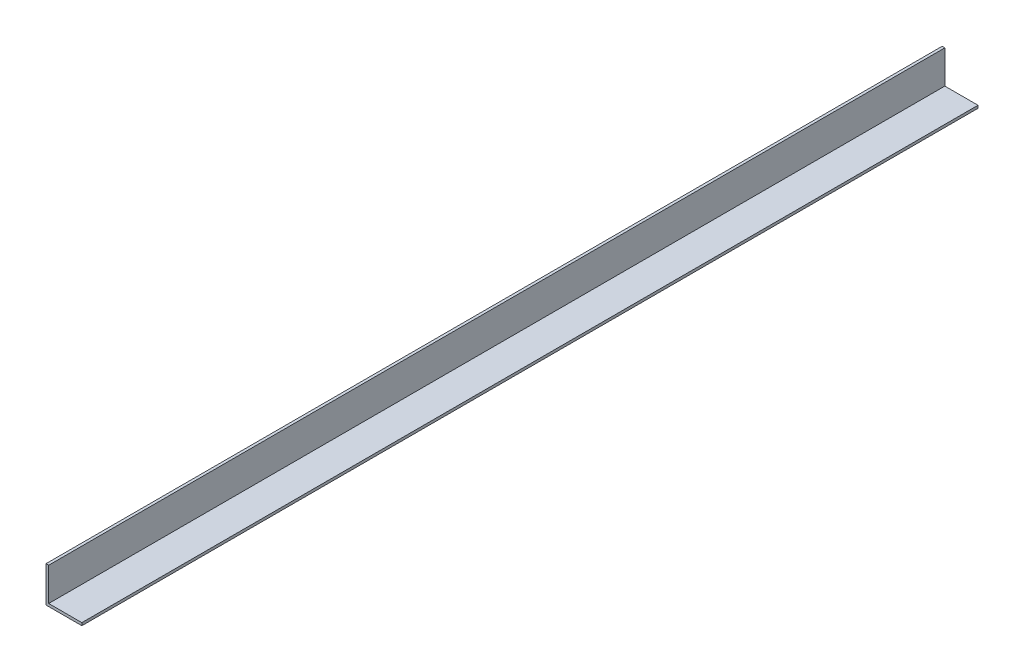
ISO-10303-21;
HEADER;
FILE_DESCRIPTION(('STEP AP214'),'2;1');
FILE_NAME('part.step','',(''),(''),'','','');
FILE_SCHEMA(('AUTOMOTIVE_DESIGN { 1 0 10303 214 1 1 1 1 }'));
ENDSEC;
DATA;
#1=APPLICATION_CONTEXT('core data for automotive mechanical design processes');
#2=APPLICATION_PROTOCOL_DEFINITION('international standard','automotive_design',2000,#1);
#3=PRODUCT_CONTEXT('',#1,'mechanical');
#4=PRODUCT('Part','Part','',(#3));
#5=PRODUCT_RELATED_PRODUCT_CATEGORY('part','',(#4));
#6=PRODUCT_DEFINITION_FORMATION('','',#4);
#7=PRODUCT_DEFINITION_CONTEXT('part definition',#1,'design');
#8=PRODUCT_DEFINITION('design','',#6,#7);
#9=PRODUCT_DEFINITION_SHAPE('','',#8);
#10=(LENGTH_UNIT() NAMED_UNIT(*) SI_UNIT(.MILLI.,.METRE.));
#11=(NAMED_UNIT(*) PLANE_ANGLE_UNIT() SI_UNIT($,.RADIAN.));
#12=(NAMED_UNIT(*) SI_UNIT($,.STERADIAN.) SOLID_ANGLE_UNIT());
#13=UNCERTAINTY_MEASURE_WITH_UNIT(LENGTH_MEASURE(1.E-05),#10,'distance_accuracy_value','');
#14=(GEOMETRIC_REPRESENTATION_CONTEXT(3) GLOBAL_UNCERTAINTY_ASSIGNED_CONTEXT((#13)) GLOBAL_UNIT_ASSIGNED_CONTEXT((#10,
#11,#12)) REPRESENTATION_CONTEXT('',''));
#15=CARTESIAN_POINT('',(0.,0.,0.));
#16=DIRECTION('',(0.,0.,1.));
#17=DIRECTION('',(1.,0.,0.));
#18=AXIS2_PLACEMENT_3D('',#15,#16,#17);
#19=CARTESIAN_POINT('',(3.,40.,1000.));
#20=DIRECTION('',(0.,-1.,0.));
#21=DIRECTION('',(0.,0.,-1.));
#22=AXIS2_PLACEMENT_3D('',#19,#20,#21);
#23=PLANE('',#22);
#24=DIRECTION('',(-1.,0.,0.));
#25=VECTOR('',#24,1.);
#26=CARTESIAN_POINT('',(3.,40.,0.));
#27=LINE('',#26,#25);
#28=CARTESIAN_POINT('',(3.,40.,0.));
#29=VERTEX_POINT('',#28);
#30=CARTESIAN_POINT('',(0.,40.,0.));
#31=VERTEX_POINT('',#30);
#32=EDGE_CURVE('E118',#29,#31,#27,.T.);
#33=ORIENTED_EDGE('',*,*,#32,.T.);
#34=DIRECTION('',(0.,0.,-1.));
#35=VECTOR('',#34,1.);
#36=CARTESIAN_POINT('',(0.,40.,1000.));
#37=LINE('',#36,#35);
#38=CARTESIAN_POINT('',(0.,40.,1000.));
#39=VERTEX_POINT('',#38);
#40=EDGE_CURVE('E11',#39,#31,#37,.T.);
#41=ORIENTED_EDGE('',*,*,#40,.F.);
#42=DIRECTION('',(-1.,0.,0.));
#43=VECTOR('',#42,1.);
#44=CARTESIAN_POINT('',(3.,40.,1000.));
#45=LINE('',#44,#43);
#46=CARTESIAN_POINT('',(3.,40.,1000.));
#47=VERTEX_POINT('',#46);
#48=EDGE_CURVE('E128',#47,#39,#45,.T.);
#49=ORIENTED_EDGE('',*,*,#48,.F.);
#50=DIRECTION('',(0.,0.,-1.));
#51=VECTOR('',#50,1.);
#52=CARTESIAN_POINT('',(3.,40.,1000.));
#53=LINE('',#52,#51);
#54=EDGE_CURVE('E114',#47,#29,#53,.T.);
#55=ORIENTED_EDGE('',*,*,#54,.T.);
#56=EDGE_LOOP('',(#33,#41,#49,#55));
#57=FACE_BOUND('',#56,.T.);
#58=ADVANCED_FACE('F34',(#57),#23,.F.);
#59=CARTESIAN_POINT('',(0.,40.,1000.));
#60=DIRECTION('',(1.,0.,0.));
#61=DIRECTION('',(0.,1.,0.));
#62=AXIS2_PLACEMENT_3D('',#59,#60,#61);
#63=PLANE('',#62);
#64=DIRECTION('',(0.,-1.,0.));
#65=VECTOR('',#64,1.);
#66=CARTESIAN_POINT('',(0.,40.,0.));
#67=LINE('',#66,#65);
#68=CARTESIAN_POINT('',(0.,0.,0.));
#69=VERTEX_POINT('',#68);
#70=EDGE_CURVE('E121',#31,#69,#67,.T.);
#71=ORIENTED_EDGE('',*,*,#70,.T.);
#72=DIRECTION('',(0.,0.,-1.));
#73=VECTOR('',#72,1.);
#74=CARTESIAN_POINT('',(0.,0.,1000.));
#75=LINE('',#74,#73);
#76=CARTESIAN_POINT('',(0.,0.,1000.));
#77=VERTEX_POINT('',#76);
#78=EDGE_CURVE('E42',#77,#69,#75,.T.);
#79=ORIENTED_EDGE('',*,*,#78,.F.);
#80=DIRECTION('',(0.,-1.,0.));
#81=VECTOR('',#80,1.);
#82=CARTESIAN_POINT('',(0.,40.,1000.));
#83=LINE('',#82,#81);
#84=EDGE_CURVE('E87',#39,#77,#83,.T.);
#85=ORIENTED_EDGE('',*,*,#84,.F.);
#86=ORIENTED_EDGE('',*,*,#40,.T.);
#87=EDGE_LOOP('',(#71,#79,#85,#86));
#88=FACE_BOUND('',#87,.T.);
#89=ADVANCED_FACE('F152',(#88),#63,.F.);
#90=CARTESIAN_POINT('',(0.,0.,1000.));
#91=DIRECTION('',(0.,1.,0.));
#92=DIRECTION('',(0.,0.,1.));
#93=AXIS2_PLACEMENT_3D('',#90,#91,#92);
#94=PLANE('',#93);
#95=DIRECTION('',(1.,0.,0.));
#96=VECTOR('',#95,1.);
#97=CARTESIAN_POINT('',(0.,0.,0.));
#98=LINE('',#97,#96);
#99=CARTESIAN_POINT('',(40.,0.,0.));
#100=VERTEX_POINT('',#99);
#101=EDGE_CURVE('E123',#69,#100,#98,.T.);
#102=ORIENTED_EDGE('',*,*,#101,.T.);
#103=DIRECTION('',(0.,0.,-1.));
#104=VECTOR('',#103,1.);
#105=CARTESIAN_POINT('',(40.,0.,1000.));
#106=LINE('',#105,#104);
#107=CARTESIAN_POINT('',(40.,0.,1000.));
#108=VERTEX_POINT('',#107);
#109=EDGE_CURVE('E109',#108,#100,#106,.T.);
#110=ORIENTED_EDGE('',*,*,#109,.F.);
#111=DIRECTION('',(1.,0.,0.));
#112=VECTOR('',#111,1.);
#113=CARTESIAN_POINT('',(0.,0.,1000.));
#114=LINE('',#113,#112);
#115=EDGE_CURVE('E100',#77,#108,#114,.T.);
#116=ORIENTED_EDGE('',*,*,#115,.F.);
#117=ORIENTED_EDGE('',*,*,#78,.T.);
#118=EDGE_LOOP('',(#102,#110,#116,#117));
#119=FACE_BOUND('',#118,.T.);
#120=ADVANCED_FACE('F134',(#119),#94,.F.);
#121=CARTESIAN_POINT('',(40.,0.,1000.));
#122=DIRECTION('',(-1.,0.,0.));
#123=DIRECTION('',(0.,0.,1.));
#124=AXIS2_PLACEMENT_3D('',#121,#122,#123);
#125=PLANE('',#124);
#126=DIRECTION('',(0.,1.,0.));
#127=VECTOR('',#126,1.);
#128=CARTESIAN_POINT('',(40.,0.,0.));
#129=LINE('',#128,#127);
#130=CARTESIAN_POINT('',(40.,3.,0.));
#131=VERTEX_POINT('',#130);
#132=EDGE_CURVE('E108',#100,#131,#129,.T.);
#133=ORIENTED_EDGE('',*,*,#132,.T.);
#134=DIRECTION('',(0.,0.,-1.));
#135=VECTOR('',#134,1.);
#136=CARTESIAN_POINT('',(40.,3.,1000.));
#137=LINE('',#136,#135);
#138=CARTESIAN_POINT('',(40.,3.,1000.));
#139=VERTEX_POINT('',#138);
#140=EDGE_CURVE('E105',#139,#131,#137,.T.);
#141=ORIENTED_EDGE('',*,*,#140,.F.);
#142=DIRECTION('',(0.,1.,0.));
#143=VECTOR('',#142,1.);
#144=CARTESIAN_POINT('',(40.,0.,1000.));
#145=LINE('',#144,#143);
#146=EDGE_CURVE('E94',#108,#139,#145,.T.);
#147=ORIENTED_EDGE('',*,*,#146,.F.);
#148=ORIENTED_EDGE('',*,*,#109,.T.);
#149=EDGE_LOOP('',(#133,#141,#147,#148));
#150=FACE_BOUND('',#149,.T.);
#151=ADVANCED_FACE('F106',(#150),#125,.F.);
#152=CARTESIAN_POINT('',(40.,3.,1000.));
#153=DIRECTION('',(0.,-1.,0.));
#154=DIRECTION('',(1.,0.,0.));
#155=AXIS2_PLACEMENT_3D('',#152,#153,#154);
#156=PLANE('',#155);
#157=DIRECTION('',(-1.,0.,0.));
#158=VECTOR('',#157,1.);
#159=CARTESIAN_POINT('',(40.,3.,0.));
#160=LINE('',#159,#158);
#161=CARTESIAN_POINT('',(3.,3.,0.));
#162=VERTEX_POINT('',#161);
#163=EDGE_CURVE('E73',#131,#162,#160,.T.);
#164=ORIENTED_EDGE('',*,*,#163,.T.);
#165=DIRECTION('',(0.,0.,-1.));
#166=VECTOR('',#165,1.);
#167=CARTESIAN_POINT('',(3.,3.,1000.));
#168=LINE('',#167,#166);
#169=CARTESIAN_POINT('',(3.,3.,1000.));
#170=VERTEX_POINT('',#169);
#171=EDGE_CURVE('E110',#170,#162,#168,.T.);
#172=ORIENTED_EDGE('',*,*,#171,.F.);
#173=DIRECTION('',(-1.,0.,0.));
#174=VECTOR('',#173,1.);
#175=CARTESIAN_POINT('',(40.,3.,1000.));
#176=LINE('',#175,#174);
#177=EDGE_CURVE('E98',#139,#170,#176,.T.);
#178=ORIENTED_EDGE('',*,*,#177,.F.);
#179=ORIENTED_EDGE('',*,*,#140,.T.);
#180=EDGE_LOOP('',(#164,#172,#178,#179));
#181=FACE_BOUND('',#180,.T.);
#182=ADVANCED_FACE('F112',(#181),#156,.F.);
#183=CARTESIAN_POINT('',(3.,3.,1000.));
#184=DIRECTION('',(-1.,0.,0.));
#185=DIRECTION('',(0.,-1.,0.));
#186=AXIS2_PLACEMENT_3D('',#183,#184,#185);
#187=PLANE('',#186);
#188=DIRECTION('',(0.,1.,0.));
#189=VECTOR('',#188,1.);
#190=CARTESIAN_POINT('',(3.,3.,0.));
#191=LINE('',#190,#189);
#192=EDGE_CURVE('E79',#162,#29,#191,.T.);
#193=ORIENTED_EDGE('',*,*,#192,.T.);
#194=ORIENTED_EDGE('',*,*,#54,.F.);
#195=DIRECTION('',(0.,1.,0.));
#196=VECTOR('',#195,1.);
#197=CARTESIAN_POINT('',(3.,3.,1000.));
#198=LINE('',#197,#196);
#199=EDGE_CURVE('E50',#170,#47,#198,.T.);
#200=ORIENTED_EDGE('',*,*,#199,.F.);
#201=ORIENTED_EDGE('',*,*,#171,.T.);
#202=EDGE_LOOP('',(#193,#194,#200,#201));
#203=FACE_BOUND('',#202,.T.);
#204=ADVANCED_FACE('F141',(#203),#187,.F.);
#205=CARTESIAN_POINT('',(0.,0.,1000.));
#206=DIRECTION('',(0.,0.,1.));
#207=DIRECTION('',(1.,0.,0.));
#208=AXIS2_PLACEMENT_3D('',#205,#206,#207);
#209=PLANE('',#208);
#210=ORIENTED_EDGE('',*,*,#48,.T.);
#211=ORIENTED_EDGE('',*,*,#84,.T.);
#212=ORIENTED_EDGE('',*,*,#115,.T.);
#213=ORIENTED_EDGE('',*,*,#146,.T.);
#214=ORIENTED_EDGE('',*,*,#177,.T.);
#215=ORIENTED_EDGE('',*,*,#199,.T.);
#216=EDGE_LOOP('',(#210,#211,#212,#213,#214,#215));
#217=FACE_BOUND('',#216,.T.);
#218=ADVANCED_FACE('F96',(#217),#209,.T.);
#219=CARTESIAN_POINT('',(0.,0.,0.));
#220=DIRECTION('',(0.,0.,1.));
#221=DIRECTION('',(1.,0.,0.));
#222=AXIS2_PLACEMENT_3D('',#219,#220,#221);
#223=PLANE('',#222);
#224=ORIENTED_EDGE('',*,*,#32,.F.);
#225=ORIENTED_EDGE('',*,*,#192,.F.);
#226=ORIENTED_EDGE('',*,*,#163,.F.);
#227=ORIENTED_EDGE('',*,*,#132,.F.);
#228=ORIENTED_EDGE('',*,*,#101,.F.);
#229=ORIENTED_EDGE('',*,*,#70,.F.);
#230=EDGE_LOOP('',(#224,#225,#226,#227,#228,#229));
#231=FACE_BOUND('',#230,.T.);
#232=ADVANCED_FACE('F137',(#231),#223,.F.);
#233=CLOSED_SHELL('',(#58,#89,#120,#151,#182,#204,#218,#232));
#234=MANIFOLD_SOLID_BREP('B2',#233);
#235=ADVANCED_BREP_SHAPE_REPRESENTATION('',(#18,#234),#14);
#236=SHAPE_DEFINITION_REPRESENTATION(#9,#235);
ENDSEC;
END-ISO-10303-21;
